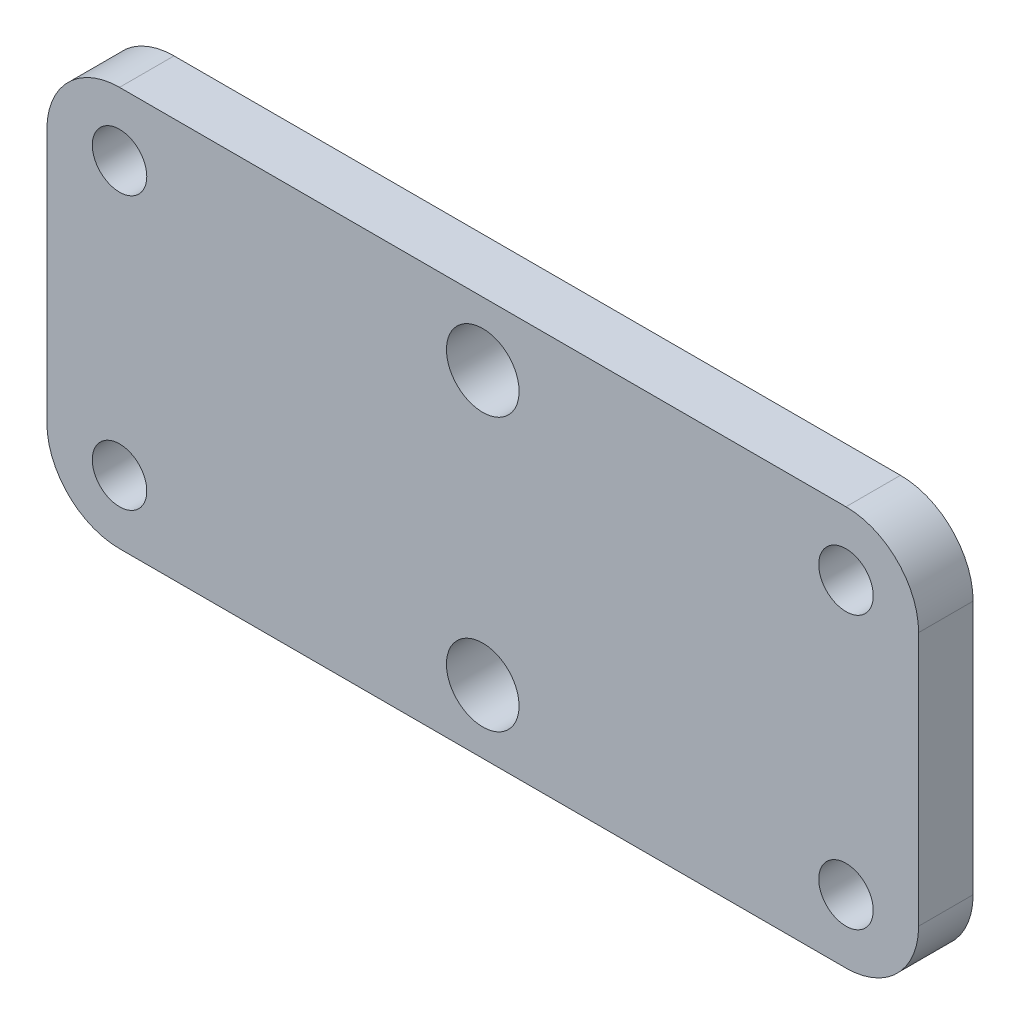
ISO-10303-21;
HEADER;
FILE_DESCRIPTION(('STEP AP214'),'2;1');
FILE_NAME('part.step','',(''),(''),'','','');
FILE_SCHEMA(('AUTOMOTIVE_DESIGN { 1 0 10303 214 1 1 1 1 }'));
ENDSEC;
DATA;
#1=APPLICATION_CONTEXT('core data for automotive mechanical design processes');
#2=APPLICATION_PROTOCOL_DEFINITION('international standard','automotive_design',2000,#1);
#3=PRODUCT_CONTEXT('',#1,'mechanical');
#4=PRODUCT('Part','Part','',(#3));
#5=PRODUCT_RELATED_PRODUCT_CATEGORY('part','',(#4));
#6=PRODUCT_DEFINITION_FORMATION('','',#4);
#7=PRODUCT_DEFINITION_CONTEXT('part definition',#1,'design');
#8=PRODUCT_DEFINITION('design','',#6,#7);
#9=PRODUCT_DEFINITION_SHAPE('','',#8);
#10=(LENGTH_UNIT() NAMED_UNIT(*) SI_UNIT(.MILLI.,.METRE.));
#11=(NAMED_UNIT(*) PLANE_ANGLE_UNIT() SI_UNIT($,.RADIAN.));
#12=(NAMED_UNIT(*) SI_UNIT($,.STERADIAN.) SOLID_ANGLE_UNIT());
#13=UNCERTAINTY_MEASURE_WITH_UNIT(LENGTH_MEASURE(1.E-05),#10,'distance_accuracy_value','');
#14=(GEOMETRIC_REPRESENTATION_CONTEXT(3) GLOBAL_UNCERTAINTY_ASSIGNED_CONTEXT((#13)) GLOBAL_UNIT_ASSIGNED_CONTEXT((#10,
#11,#12)) REPRESENTATION_CONTEXT('',''));
#15=CARTESIAN_POINT('',(0.,0.,0.));
#16=DIRECTION('',(0.,0.,1.));
#17=DIRECTION('',(1.,0.,0.));
#18=AXIS2_PLACEMENT_3D('',#15,#16,#17);
#19=CARTESIAN_POINT('',(0.,0.,3.));
#20=DIRECTION('',(0.,0.,1.));
#21=DIRECTION('',(1.,0.,0.));
#22=AXIS2_PLACEMENT_3D('',#19,#20,#21);
#23=PLANE('',#22);
#24=CARTESIAN_POINT('',(44.,-18.5,3.));
#25=DIRECTION('',(0.,0.,1.));
#26=DIRECTION('',(1.,0.,0.));
#27=AXIS2_PLACEMENT_3D('',#24,#25,#26);
#28=CIRCLE('',#27,1.5);
#29=CARTESIAN_POINT('',(45.5,-18.5,3.));
#30=VERTEX_POINT('',#29);
#31=EDGE_CURVE('E193',#30,#30,#28,.T.);
#32=ORIENTED_EDGE('',*,*,#31,.F.);
#33=EDGE_LOOP('',(#32));
#34=FACE_BOUND('',#33,.T.);
#35=CARTESIAN_POINT('',(4.,-3.5,3.));
#36=DIRECTION('',(0.,0.,1.));
#37=DIRECTION('',(1.,0.,0.));
#38=AXIS2_PLACEMENT_3D('',#35,#36,#37);
#39=CIRCLE('',#38,1.5);
#40=CARTESIAN_POINT('',(5.5,-3.5,3.));
#41=VERTEX_POINT('',#40);
#42=EDGE_CURVE('E181',#41,#41,#39,.T.);
#43=ORIENTED_EDGE('',*,*,#42,.F.);
#44=EDGE_LOOP('',(#43));
#45=FACE_BOUND('',#44,.T.);
#46=CARTESIAN_POINT('',(24.,-3.5,3.));
#47=DIRECTION('',(0.,0.,1.));
#48=DIRECTION('',(1.,0.,0.));
#49=AXIS2_PLACEMENT_3D('',#46,#47,#48);
#50=CIRCLE('',#49,2.);
#51=CARTESIAN_POINT('',(26.,-3.5,3.));
#52=VERTEX_POINT('',#51);
#53=EDGE_CURVE('E164',#52,#52,#50,.T.);
#54=ORIENTED_EDGE('',*,*,#53,.F.);
#55=EDGE_LOOP('',(#54));
#56=FACE_BOUND('',#55,.T.);
#57=DIRECTION('',(0.,1.,0.));
#58=VECTOR('',#57,1.);
#59=CARTESIAN_POINT('',(48.,0.,3.));
#60=LINE('',#59,#58);
#61=CARTESIAN_POINT('',(48.,-18.,3.));
#62=VERTEX_POINT('',#61);
#63=CARTESIAN_POINT('',(48.,-4.,3.));
#64=VERTEX_POINT('',#63);
#65=EDGE_CURVE('E171',#62,#64,#60,.T.);
#66=ORIENTED_EDGE('',*,*,#65,.T.);
#67=CARTESIAN_POINT('',(44.,-4.,3.));
#68=DIRECTION('',(0.,0.,1.));
#69=DIRECTION('',(1.,0.,0.));
#70=AXIS2_PLACEMENT_3D('',#67,#68,#69);
#71=CIRCLE('',#70,4.);
#72=CARTESIAN_POINT('',(44.,0.,3.));
#73=VERTEX_POINT('',#72);
#74=EDGE_CURVE('E148',#64,#73,#71,.T.);
#75=ORIENTED_EDGE('',*,*,#74,.T.);
#76=DIRECTION('',(-1.,0.,0.));
#77=VECTOR('',#76,1.);
#78=CARTESIAN_POINT('',(0.,0.,3.));
#79=LINE('',#78,#77);
#80=CARTESIAN_POINT('',(4.,0.,3.));
#81=VERTEX_POINT('',#80);
#82=EDGE_CURVE('E119',#73,#81,#79,.T.);
#83=ORIENTED_EDGE('',*,*,#82,.T.);
#84=CARTESIAN_POINT('',(4.,-4.,3.));
#85=DIRECTION('',(0.,0.,1.));
#86=DIRECTION('',(1.,0.,0.));
#87=AXIS2_PLACEMENT_3D('',#84,#85,#86);
#88=CIRCLE('',#87,4.);
#89=CARTESIAN_POINT('',(0.,-4.,3.));
#90=VERTEX_POINT('',#89);
#91=EDGE_CURVE('E143',#81,#90,#88,.T.);
#92=ORIENTED_EDGE('',*,*,#91,.T.);
#93=DIRECTION('',(0.,-1.,0.));
#94=VECTOR('',#93,1.);
#95=CARTESIAN_POINT('',(0.,0.,3.));
#96=LINE('',#95,#94);
#97=CARTESIAN_POINT('',(0.,-18.,3.));
#98=VERTEX_POINT('',#97);
#99=EDGE_CURVE('E126',#90,#98,#96,.T.);
#100=ORIENTED_EDGE('',*,*,#99,.T.);
#101=CARTESIAN_POINT('',(4.,-18.,3.));
#102=DIRECTION('',(0.,0.,1.));
#103=DIRECTION('',(1.,0.,0.));
#104=AXIS2_PLACEMENT_3D('',#101,#102,#103);
#105=CIRCLE('',#104,4.);
#106=CARTESIAN_POINT('',(4.,-22.,3.));
#107=VERTEX_POINT('',#106);
#108=EDGE_CURVE('E55',#98,#107,#105,.T.);
#109=ORIENTED_EDGE('',*,*,#108,.T.);
#110=DIRECTION('',(1.,0.,0.));
#111=VECTOR('',#110,1.);
#112=CARTESIAN_POINT('',(0.,-22.,3.));
#113=LINE('',#112,#111);
#114=CARTESIAN_POINT('',(44.,-22.,3.));
#115=VERTEX_POINT('',#114);
#116=EDGE_CURVE('E129',#107,#115,#113,.T.);
#117=ORIENTED_EDGE('',*,*,#116,.T.);
#118=CARTESIAN_POINT('',(44.,-18.,3.));
#119=DIRECTION('',(0.,0.,1.));
#120=DIRECTION('',(1.,0.,0.));
#121=AXIS2_PLACEMENT_3D('',#118,#119,#120);
#122=CIRCLE('',#121,4.);
#123=EDGE_CURVE('E146',#115,#62,#122,.T.);
#124=ORIENTED_EDGE('',*,*,#123,.T.);
#125=EDGE_LOOP('',(#66,#75,#83,#92,#100,#109,#117,#124));
#126=FACE_BOUND('',#125,.T.);
#127=CARTESIAN_POINT('',(24.,-18.5,3.));
#128=DIRECTION('',(0.,0.,1.));
#129=DIRECTION('',(-1.,0.,0.));
#130=AXIS2_PLACEMENT_3D('',#127,#128,#129);
#131=CIRCLE('',#130,2.);
#132=CARTESIAN_POINT('',(22.,-18.5,3.));
#133=VERTEX_POINT('',#132);
#134=EDGE_CURVE('E176',#133,#133,#131,.T.);
#135=ORIENTED_EDGE('',*,*,#134,.F.);
#136=EDGE_LOOP('',(#135));
#137=FACE_BOUND('',#136,.T.);
#138=CARTESIAN_POINT('',(44.,-3.5,3.));
#139=DIRECTION('',(0.,0.,1.));
#140=DIRECTION('',(-1.,0.,0.));
#141=AXIS2_PLACEMENT_3D('',#138,#139,#140);
#142=CIRCLE('',#141,1.5);
#143=CARTESIAN_POINT('',(42.5,-3.5,3.));
#144=VERTEX_POINT('',#143);
#145=EDGE_CURVE('E187',#144,#144,#142,.T.);
#146=ORIENTED_EDGE('',*,*,#145,.F.);
#147=EDGE_LOOP('',(#146));
#148=FACE_BOUND('',#147,.T.);
#149=CARTESIAN_POINT('',(4.,-18.5,3.));
#150=DIRECTION('',(0.,0.,1.));
#151=DIRECTION('',(-1.,0.,0.));
#152=AXIS2_PLACEMENT_3D('',#149,#150,#151);
#153=CIRCLE('',#152,1.5);
#154=CARTESIAN_POINT('',(2.5,-18.5,3.));
#155=VERTEX_POINT('',#154);
#156=EDGE_CURVE('E199',#155,#155,#153,.T.);
#157=ORIENTED_EDGE('',*,*,#156,.F.);
#158=EDGE_LOOP('',(#157));
#159=FACE_BOUND('',#158,.T.);
#160=ADVANCED_FACE('F33',(#34,#45,#56,#126,#137,#148,#159),#23,.T.);
#161=CARTESIAN_POINT('',(0.,0.,0.));
#162=DIRECTION('',(0.,0.,1.));
#163=DIRECTION('',(1.,0.,0.));
#164=AXIS2_PLACEMENT_3D('',#161,#162,#163);
#165=PLANE('',#164);
#166=DIRECTION('',(-1.,0.,0.));
#167=VECTOR('',#166,1.);
#168=CARTESIAN_POINT('',(0.,0.,0.));
#169=LINE('',#168,#167);
#170=CARTESIAN_POINT('',(44.,0.,0.));
#171=VERTEX_POINT('',#170);
#172=CARTESIAN_POINT('',(4.,0.,0.));
#173=VERTEX_POINT('',#172);
#174=EDGE_CURVE('E116',#171,#173,#169,.T.);
#175=ORIENTED_EDGE('',*,*,#174,.F.);
#176=CARTESIAN_POINT('',(44.,-4.,0.));
#177=DIRECTION('',(0.,0.,1.));
#178=DIRECTION('',(1.,0.,0.));
#179=AXIS2_PLACEMENT_3D('',#176,#177,#178);
#180=CIRCLE('',#179,4.);
#181=CARTESIAN_POINT('',(48.,-4.,0.));
#182=VERTEX_POINT('',#181);
#183=EDGE_CURVE('E99',#171,#182,#180,.F.);
#184=ORIENTED_EDGE('',*,*,#183,.T.);
#185=DIRECTION('',(0.,1.,0.));
#186=VECTOR('',#185,1.);
#187=CARTESIAN_POINT('',(48.,0.,0.));
#188=LINE('',#187,#186);
#189=CARTESIAN_POINT('',(48.,-18.,0.));
#190=VERTEX_POINT('',#189);
#191=EDGE_CURVE('E127',#190,#182,#188,.T.);
#192=ORIENTED_EDGE('',*,*,#191,.F.);
#193=CARTESIAN_POINT('',(44.,-18.,0.));
#194=DIRECTION('',(0.,0.,1.));
#195=DIRECTION('',(1.,0.,0.));
#196=AXIS2_PLACEMENT_3D('',#193,#194,#195);
#197=CIRCLE('',#196,4.);
#198=CARTESIAN_POINT('',(44.,-22.,0.));
#199=VERTEX_POINT('',#198);
#200=EDGE_CURVE('E110',#190,#199,#197,.F.);
#201=ORIENTED_EDGE('',*,*,#200,.T.);
#202=DIRECTION('',(1.,0.,0.));
#203=VECTOR('',#202,1.);
#204=CARTESIAN_POINT('',(0.,-22.,0.));
#205=LINE('',#204,#203);
#206=CARTESIAN_POINT('',(4.,-22.,0.));
#207=VERTEX_POINT('',#206);
#208=EDGE_CURVE('E131',#207,#199,#205,.T.);
#209=ORIENTED_EDGE('',*,*,#208,.F.);
#210=CARTESIAN_POINT('',(4.,-18.,0.));
#211=DIRECTION('',(0.,0.,1.));
#212=DIRECTION('',(1.,0.,0.));
#213=AXIS2_PLACEMENT_3D('',#210,#211,#212);
#214=CIRCLE('',#213,4.);
#215=CARTESIAN_POINT('',(0.,-18.,0.));
#216=VERTEX_POINT('',#215);
#217=EDGE_CURVE('E137',#207,#216,#214,.F.);
#218=ORIENTED_EDGE('',*,*,#217,.T.);
#219=DIRECTION('',(0.,-1.,0.));
#220=VECTOR('',#219,1.);
#221=CARTESIAN_POINT('',(0.,0.,0.));
#222=LINE('',#221,#220);
#223=CARTESIAN_POINT('',(0.,-4.,0.));
#224=VERTEX_POINT('',#223);
#225=EDGE_CURVE('E159',#224,#216,#222,.T.);
#226=ORIENTED_EDGE('',*,*,#225,.F.);
#227=CARTESIAN_POINT('',(4.,-4.,0.));
#228=DIRECTION('',(0.,0.,1.));
#229=DIRECTION('',(1.,0.,0.));
#230=AXIS2_PLACEMENT_3D('',#227,#228,#229);
#231=CIRCLE('',#230,4.);
#232=EDGE_CURVE('E120',#224,#173,#231,.F.);
#233=ORIENTED_EDGE('',*,*,#232,.T.);
#234=EDGE_LOOP('',(#175,#184,#192,#201,#209,#218,#226,#233));
#235=FACE_BOUND('',#234,.T.);
#236=CARTESIAN_POINT('',(24.,-3.5,0.));
#237=DIRECTION('',(0.,0.,1.));
#238=DIRECTION('',(1.,0.,0.));
#239=AXIS2_PLACEMENT_3D('',#236,#237,#238);
#240=CIRCLE('',#239,2.);
#241=CARTESIAN_POINT('',(26.,-3.5,0.));
#242=VERTEX_POINT('',#241);
#243=EDGE_CURVE('E167',#242,#242,#240,.T.);
#244=ORIENTED_EDGE('',*,*,#243,.T.);
#245=EDGE_LOOP('',(#244));
#246=FACE_BOUND('',#245,.T.);
#247=CARTESIAN_POINT('',(24.,-18.5,0.));
#248=DIRECTION('',(0.,0.,1.));
#249=DIRECTION('',(-1.,0.,0.));
#250=AXIS2_PLACEMENT_3D('',#247,#248,#249);
#251=CIRCLE('',#250,2.);
#252=CARTESIAN_POINT('',(22.,-18.5,0.));
#253=VERTEX_POINT('',#252);
#254=EDGE_CURVE('E178',#253,#253,#251,.T.);
#255=ORIENTED_EDGE('',*,*,#254,.T.);
#256=EDGE_LOOP('',(#255));
#257=FACE_BOUND('',#256,.T.);
#258=CARTESIAN_POINT('',(4.,-3.5,0.));
#259=DIRECTION('',(0.,0.,1.));
#260=DIRECTION('',(1.,0.,0.));
#261=AXIS2_PLACEMENT_3D('',#258,#259,#260);
#262=CIRCLE('',#261,1.5);
#263=CARTESIAN_POINT('',(5.5,-3.5,0.));
#264=VERTEX_POINT('',#263);
#265=EDGE_CURVE('E184',#264,#264,#262,.T.);
#266=ORIENTED_EDGE('',*,*,#265,.T.);
#267=EDGE_LOOP('',(#266));
#268=FACE_BOUND('',#267,.T.);
#269=CARTESIAN_POINT('',(44.,-3.5,0.));
#270=DIRECTION('',(0.,0.,1.));
#271=DIRECTION('',(-1.,0.,0.));
#272=AXIS2_PLACEMENT_3D('',#269,#270,#271);
#273=CIRCLE('',#272,1.5);
#274=CARTESIAN_POINT('',(42.5,-3.5,0.));
#275=VERTEX_POINT('',#274);
#276=EDGE_CURVE('E190',#275,#275,#273,.T.);
#277=ORIENTED_EDGE('',*,*,#276,.T.);
#278=EDGE_LOOP('',(#277));
#279=FACE_BOUND('',#278,.T.);
#280=CARTESIAN_POINT('',(44.,-18.5,0.));
#281=DIRECTION('',(0.,0.,1.));
#282=DIRECTION('',(1.,0.,0.));
#283=AXIS2_PLACEMENT_3D('',#280,#281,#282);
#284=CIRCLE('',#283,1.5);
#285=CARTESIAN_POINT('',(45.5,-18.5,0.));
#286=VERTEX_POINT('',#285);
#287=EDGE_CURVE('E196',#286,#286,#284,.T.);
#288=ORIENTED_EDGE('',*,*,#287,.T.);
#289=EDGE_LOOP('',(#288));
#290=FACE_BOUND('',#289,.T.);
#291=CARTESIAN_POINT('',(4.,-18.5,0.));
#292=DIRECTION('',(0.,0.,1.));
#293=DIRECTION('',(-1.,0.,0.));
#294=AXIS2_PLACEMENT_3D('',#291,#292,#293);
#295=CIRCLE('',#294,1.5);
#296=CARTESIAN_POINT('',(2.5,-18.5,0.));
#297=VERTEX_POINT('',#296);
#298=EDGE_CURVE('E202',#297,#297,#295,.T.);
#299=ORIENTED_EDGE('',*,*,#298,.T.);
#300=EDGE_LOOP('',(#299));
#301=FACE_BOUND('',#300,.T.);
#302=ADVANCED_FACE('F123',(#235,#246,#257,#268,#279,#290,#301),#165,.F.);
#303=CARTESIAN_POINT('',(0.,0.,3.));
#304=DIRECTION('',(1.,0.,0.));
#305=DIRECTION('',(0.,1.,0.));
#306=AXIS2_PLACEMENT_3D('',#303,#304,#305);
#307=PLANE('',#306);
#308=ORIENTED_EDGE('',*,*,#225,.T.);
#309=DIRECTION('',(0.,0.,-1.));
#310=VECTOR('',#309,1.);
#311=CARTESIAN_POINT('',(0.,-18.,3.));
#312=LINE('',#311,#310);
#313=EDGE_CURVE('E11',#216,#98,#312,.F.);
#314=ORIENTED_EDGE('',*,*,#313,.T.);
#315=ORIENTED_EDGE('',*,*,#99,.F.);
#316=DIRECTION('',(0.,0.,-1.));
#317=VECTOR('',#316,1.);
#318=CARTESIAN_POINT('',(0.,-4.,3.));
#319=LINE('',#318,#317);
#320=EDGE_CURVE('E41',#90,#224,#319,.T.);
#321=ORIENTED_EDGE('',*,*,#320,.T.);
#322=EDGE_LOOP('',(#308,#314,#315,#321));
#323=FACE_BOUND('',#322,.T.);
#324=ADVANCED_FACE('F158',(#323),#307,.F.);
#325=CARTESIAN_POINT('',(0.,-22.,3.));
#326=DIRECTION('',(0.,1.,0.));
#327=DIRECTION('',(0.,0.,1.));
#328=AXIS2_PLACEMENT_3D('',#325,#326,#327);
#329=PLANE('',#328);
#330=ORIENTED_EDGE('',*,*,#208,.T.);
#331=DIRECTION('',(0.,0.,-1.));
#332=VECTOR('',#331,1.);
#333=CARTESIAN_POINT('',(44.,-22.,3.));
#334=LINE('',#333,#332);
#335=EDGE_CURVE('E48',#199,#115,#334,.F.);
#336=ORIENTED_EDGE('',*,*,#335,.T.);
#337=ORIENTED_EDGE('',*,*,#116,.F.);
#338=DIRECTION('',(0.,0.,-1.));
#339=VECTOR('',#338,1.);
#340=CARTESIAN_POINT('',(4.,-22.,3.));
#341=LINE('',#340,#339);
#342=EDGE_CURVE('E150',#107,#207,#341,.T.);
#343=ORIENTED_EDGE('',*,*,#342,.T.);
#344=EDGE_LOOP('',(#330,#336,#337,#343));
#345=FACE_BOUND('',#344,.T.);
#346=ADVANCED_FACE('F229',(#345),#329,.F.);
#347=CARTESIAN_POINT('',(48.,0.,3.));
#348=DIRECTION('',(-1.,0.,0.));
#349=DIRECTION('',(0.,0.,1.));
#350=AXIS2_PLACEMENT_3D('',#347,#348,#349);
#351=PLANE('',#350);
#352=ORIENTED_EDGE('',*,*,#191,.T.);
#353=DIRECTION('',(0.,0.,-1.));
#354=VECTOR('',#353,1.);
#355=CARTESIAN_POINT('',(48.,-4.,3.));
#356=LINE('',#355,#354);
#357=EDGE_CURVE('E104',#182,#64,#356,.F.);
#358=ORIENTED_EDGE('',*,*,#357,.T.);
#359=ORIENTED_EDGE('',*,*,#65,.F.);
#360=DIRECTION('',(0.,0.,-1.));
#361=VECTOR('',#360,1.);
#362=CARTESIAN_POINT('',(48.,-18.,3.));
#363=LINE('',#362,#361);
#364=EDGE_CURVE('E109',#62,#190,#363,.T.);
#365=ORIENTED_EDGE('',*,*,#364,.T.);
#366=EDGE_LOOP('',(#352,#358,#359,#365));
#367=FACE_BOUND('',#366,.T.);
#368=ADVANCED_FACE('F226',(#367),#351,.F.);
#369=CARTESIAN_POINT('',(0.,0.,3.));
#370=DIRECTION('',(0.,-1.,0.));
#371=DIRECTION('',(1.,0.,0.));
#372=AXIS2_PLACEMENT_3D('',#369,#370,#371);
#373=PLANE('',#372);
#374=ORIENTED_EDGE('',*,*,#82,.F.);
#375=DIRECTION('',(0.,0.,-1.));
#376=VECTOR('',#375,1.);
#377=CARTESIAN_POINT('',(44.,0.,3.));
#378=LINE('',#377,#376);
#379=EDGE_CURVE('E103',#73,#171,#378,.T.);
#380=ORIENTED_EDGE('',*,*,#379,.T.);
#381=ORIENTED_EDGE('',*,*,#174,.T.);
#382=DIRECTION('',(0.,0.,-1.));
#383=VECTOR('',#382,1.);
#384=CARTESIAN_POINT('',(4.,0.,3.));
#385=LINE('',#384,#383);
#386=EDGE_CURVE('E121',#173,#81,#385,.F.);
#387=ORIENTED_EDGE('',*,*,#386,.T.);
#388=EDGE_LOOP('',(#374,#380,#381,#387));
#389=FACE_BOUND('',#388,.T.);
#390=ADVANCED_FACE('F115',(#389),#373,.F.);
#391=CARTESIAN_POINT('',(24.,-3.5,3.));
#392=DIRECTION('',(0.,0.,-1.));
#393=DIRECTION('',(-1.,0.,0.));
#394=AXIS2_PLACEMENT_3D('',#391,#392,#393);
#395=CYLINDRICAL_SURFACE('',#394,2.);
#396=ORIENTED_EDGE('',*,*,#53,.T.);
#397=EDGE_LOOP('',(#396));
#398=FACE_BOUND('',#397,.T.);
#399=ORIENTED_EDGE('',*,*,#243,.F.);
#400=EDGE_LOOP('',(#399));
#401=FACE_BOUND('',#400,.T.);
#402=ADVANCED_FACE('F221',(#398,#401),#395,.F.);
#403=CARTESIAN_POINT('',(24.,-18.5,3.));
#404=DIRECTION('',(0.,0.,-1.));
#405=DIRECTION('',(-1.,0.,0.));
#406=AXIS2_PLACEMENT_3D('',#403,#404,#405);
#407=CYLINDRICAL_SURFACE('',#406,2.);
#408=ORIENTED_EDGE('',*,*,#134,.T.);
#409=EDGE_LOOP('',(#408));
#410=FACE_BOUND('',#409,.T.);
#411=ORIENTED_EDGE('',*,*,#254,.F.);
#412=EDGE_LOOP('',(#411));
#413=FACE_BOUND('',#412,.T.);
#414=ADVANCED_FACE('F276',(#410,#413),#407,.F.);
#415=CARTESIAN_POINT('',(4.,-3.5,3.));
#416=DIRECTION('',(0.,0.,-1.));
#417=DIRECTION('',(-1.,0.,0.));
#418=AXIS2_PLACEMENT_3D('',#415,#416,#417);
#419=CYLINDRICAL_SURFACE('',#418,1.5);
#420=ORIENTED_EDGE('',*,*,#42,.T.);
#421=EDGE_LOOP('',(#420));
#422=FACE_BOUND('',#421,.T.);
#423=ORIENTED_EDGE('',*,*,#265,.F.);
#424=EDGE_LOOP('',(#423));
#425=FACE_BOUND('',#424,.T.);
#426=ADVANCED_FACE('F259',(#422,#425),#419,.F.);
#427=CARTESIAN_POINT('',(44.,-3.5,3.));
#428=DIRECTION('',(0.,0.,-1.));
#429=DIRECTION('',(-1.,0.,0.));
#430=AXIS2_PLACEMENT_3D('',#427,#428,#429);
#431=CYLINDRICAL_SURFACE('',#430,1.5);
#432=ORIENTED_EDGE('',*,*,#145,.T.);
#433=EDGE_LOOP('',(#432));
#434=FACE_BOUND('',#433,.T.);
#435=ORIENTED_EDGE('',*,*,#276,.F.);
#436=EDGE_LOOP('',(#435));
#437=FACE_BOUND('',#436,.T.);
#438=ADVANCED_FACE('F255',(#434,#437),#431,.F.);
#439=CARTESIAN_POINT('',(44.,-18.5,3.));
#440=DIRECTION('',(0.,0.,-1.));
#441=DIRECTION('',(-1.,0.,0.));
#442=AXIS2_PLACEMENT_3D('',#439,#440,#441);
#443=CYLINDRICAL_SURFACE('',#442,1.5);
#444=ORIENTED_EDGE('',*,*,#31,.T.);
#445=EDGE_LOOP('',(#444));
#446=FACE_BOUND('',#445,.T.);
#447=ORIENTED_EDGE('',*,*,#287,.F.);
#448=EDGE_LOOP('',(#447));
#449=FACE_BOUND('',#448,.T.);
#450=ADVANCED_FACE('F258',(#446,#449),#443,.F.);
#451=CARTESIAN_POINT('',(4.,-18.5,3.));
#452=DIRECTION('',(0.,0.,-1.));
#453=DIRECTION('',(-1.,0.,0.));
#454=AXIS2_PLACEMENT_3D('',#451,#452,#453);
#455=CYLINDRICAL_SURFACE('',#454,1.5);
#456=ORIENTED_EDGE('',*,*,#156,.T.);
#457=EDGE_LOOP('',(#456));
#458=FACE_BOUND('',#457,.T.);
#459=ORIENTED_EDGE('',*,*,#298,.F.);
#460=EDGE_LOOP('',(#459));
#461=FACE_BOUND('',#460,.T.);
#462=ADVANCED_FACE('F208',(#458,#461),#455,.F.);
#463=CARTESIAN_POINT('',(44.,-4.,3.));
#464=DIRECTION('',(0.,0.,-1.));
#465=DIRECTION('',(-1.,0.,0.));
#466=AXIS2_PLACEMENT_3D('',#463,#464,#465);
#467=CYLINDRICAL_SURFACE('',#466,4.);
#468=ORIENTED_EDGE('',*,*,#74,.F.);
#469=ORIENTED_EDGE('',*,*,#357,.F.);
#470=ORIENTED_EDGE('',*,*,#183,.F.);
#471=ORIENTED_EDGE('',*,*,#379,.F.);
#472=EDGE_LOOP('',(#468,#469,#470,#471));
#473=FACE_BOUND('',#472,.T.);
#474=ADVANCED_FACE('F102',(#473),#467,.T.);
#475=CARTESIAN_POINT('',(44.,-18.,3.));
#476=DIRECTION('',(0.,0.,-1.));
#477=DIRECTION('',(-1.,0.,0.));
#478=AXIS2_PLACEMENT_3D('',#475,#476,#477);
#479=CYLINDRICAL_SURFACE('',#478,4.);
#480=ORIENTED_EDGE('',*,*,#123,.F.);
#481=ORIENTED_EDGE('',*,*,#335,.F.);
#482=ORIENTED_EDGE('',*,*,#200,.F.);
#483=ORIENTED_EDGE('',*,*,#364,.F.);
#484=EDGE_LOOP('',(#480,#481,#482,#483));
#485=FACE_BOUND('',#484,.T.);
#486=ADVANCED_FACE('F237',(#485),#479,.T.);
#487=CARTESIAN_POINT('',(4.,-18.,3.));
#488=DIRECTION('',(0.,0.,-1.));
#489=DIRECTION('',(-1.,0.,0.));
#490=AXIS2_PLACEMENT_3D('',#487,#488,#489);
#491=CYLINDRICAL_SURFACE('',#490,4.);
#492=ORIENTED_EDGE('',*,*,#108,.F.);
#493=ORIENTED_EDGE('',*,*,#313,.F.);
#494=ORIENTED_EDGE('',*,*,#217,.F.);
#495=ORIENTED_EDGE('',*,*,#342,.F.);
#496=EDGE_LOOP('',(#492,#493,#494,#495));
#497=FACE_BOUND('',#496,.T.);
#498=ADVANCED_FACE('F239',(#497),#491,.T.);
#499=CARTESIAN_POINT('',(4.,-4.,3.));
#500=DIRECTION('',(0.,0.,-1.));
#501=DIRECTION('',(-1.,0.,0.));
#502=AXIS2_PLACEMENT_3D('',#499,#500,#501);
#503=CYLINDRICAL_SURFACE('',#502,4.);
#504=ORIENTED_EDGE('',*,*,#91,.F.);
#505=ORIENTED_EDGE('',*,*,#386,.F.);
#506=ORIENTED_EDGE('',*,*,#232,.F.);
#507=ORIENTED_EDGE('',*,*,#320,.F.);
#508=EDGE_LOOP('',(#504,#505,#506,#507));
#509=FACE_BOUND('',#508,.T.);
#510=ADVANCED_FACE('F35',(#509),#503,.T.);
#511=CLOSED_SHELL('',(#160,#302,#324,#346,#368,#390,#402,#414,#426,#438,#450,#462,#474,#486,
#498,#510));
#512=MANIFOLD_SOLID_BREP('B2',#511);
#513=ADVANCED_BREP_SHAPE_REPRESENTATION('',(#18,#512),#14);
#514=SHAPE_DEFINITION_REPRESENTATION(#9,#513);
ENDSEC;
END-ISO-10303-21;
